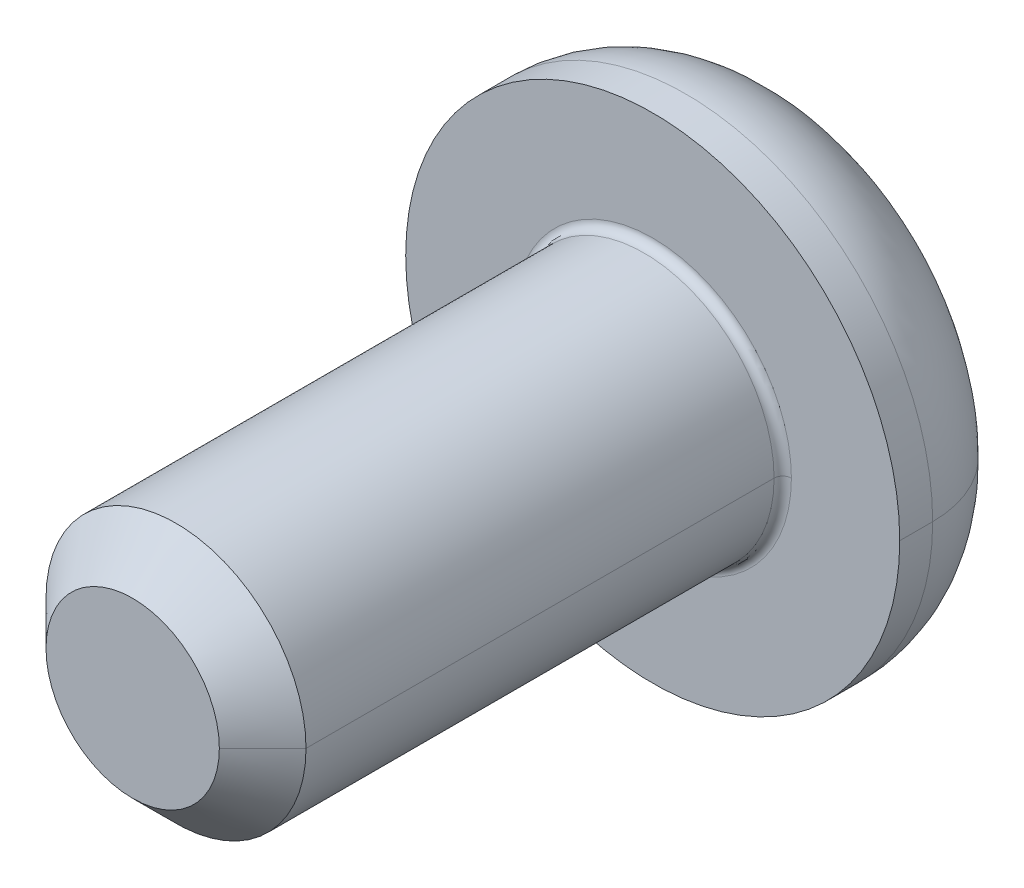
ISO-10303-21;
HEADER;
FILE_DESCRIPTION(('STEP AP214'),'2;1');
FILE_NAME('part.step','',(''),(''),'','','');
FILE_SCHEMA(('AUTOMOTIVE_DESIGN { 1 0 10303 214 1 1 1 1 }'));
ENDSEC;
DATA;
#1=APPLICATION_CONTEXT('core data for automotive mechanical design processes');
#2=APPLICATION_PROTOCOL_DEFINITION('international standard','automotive_design',2000,#1);
#3=PRODUCT_CONTEXT('',#1,'mechanical');
#4=PRODUCT('Part','Part','',(#3));
#5=PRODUCT_RELATED_PRODUCT_CATEGORY('part','',(#4));
#6=PRODUCT_DEFINITION_FORMATION('','',#4);
#7=PRODUCT_DEFINITION_CONTEXT('part definition',#1,'design');
#8=PRODUCT_DEFINITION('design','',#6,#7);
#9=PRODUCT_DEFINITION_SHAPE('','',#8);
#10=(LENGTH_UNIT() NAMED_UNIT(*) SI_UNIT(.MILLI.,.METRE.));
#11=(NAMED_UNIT(*) PLANE_ANGLE_UNIT() SI_UNIT($,.RADIAN.));
#12=(NAMED_UNIT(*) SI_UNIT($,.STERADIAN.) SOLID_ANGLE_UNIT());
#13=UNCERTAINTY_MEASURE_WITH_UNIT(LENGTH_MEASURE(1.E-05),#10,'distance_accuracy_value','');
#14=(GEOMETRIC_REPRESENTATION_CONTEXT(3) GLOBAL_UNCERTAINTY_ASSIGNED_CONTEXT((#13)) GLOBAL_UNIT_ASSIGNED_CONTEXT((#10,
#11,#12)) REPRESENTATION_CONTEXT('',''));
#15=CARTESIAN_POINT('',(0.,0.,0.));
#16=DIRECTION('',(0.,0.,1.));
#17=DIRECTION('',(1.,0.,0.));
#18=AXIS2_PLACEMENT_3D('',#15,#16,#17);
#19=CARTESIAN_POINT('',(0.,0.,0.1));
#20=DIRECTION('',(0.,0.,-1.));
#21=DIRECTION('',(-1.,0.,0.));
#22=AXIS2_PLACEMENT_3D('',#19,#20,#21);
#23=TOROIDAL_SURFACE('',#22,1.6,0.1);
#24=CARTESIAN_POINT('',(1.6,0.,0.1));
#25=DIRECTION('',(0.,1.,0.));
#26=DIRECTION('',(-1.,0.,0.));
#27=AXIS2_PLACEMENT_3D('',#24,#25,#26);
#28=CIRCLE('',#27,0.1);
#29=CARTESIAN_POINT('',(1.6,0.,0.));
#30=VERTEX_POINT('',#29);
#31=CARTESIAN_POINT('',(1.5,0.,0.1));
#32=VERTEX_POINT('',#31);
#33=EDGE_CURVE('E271',#30,#32,#28,.T.);
#34=ORIENTED_EDGE('',*,*,#33,.F.);
#35=CARTESIAN_POINT('',(0.,0.,0.));
#36=DIRECTION('',(0.,0.,-1.));
#37=DIRECTION('',(-1.,0.,0.));
#38=AXIS2_PLACEMENT_3D('',#35,#36,#37);
#39=CIRCLE('',#38,1.6);
#40=CARTESIAN_POINT('',(-1.6,0.,0.));
#41=VERTEX_POINT('',#40);
#42=EDGE_CURVE('E157',#41,#30,#39,.T.);
#43=ORIENTED_EDGE('',*,*,#42,.F.);
#44=CARTESIAN_POINT('',(-1.6,0.,0.1));
#45=DIRECTION('',(0.,-1.,0.));
#46=DIRECTION('',(0.,0.,-1.));
#47=AXIS2_PLACEMENT_3D('',#44,#45,#46);
#48=CIRCLE('',#47,0.1);
#49=CARTESIAN_POINT('',(-1.5,0.,0.1));
#50=VERTEX_POINT('',#49);
#51=EDGE_CURVE('E270',#41,#50,#48,.T.);
#52=ORIENTED_EDGE('',*,*,#51,.T.);
#53=CARTESIAN_POINT('',(0.,0.,0.1));
#54=DIRECTION('',(0.,0.,1.));
#55=DIRECTION('',(-1.,0.,0.));
#56=AXIS2_PLACEMENT_3D('',#53,#54,#55);
#57=CIRCLE('',#56,1.5);
#58=EDGE_CURVE('E212',#32,#50,#57,.T.);
#59=ORIENTED_EDGE('',*,*,#58,.F.);
#60=EDGE_LOOP('',(#34,#43,#52,#59));
#61=FACE_BOUND('',#60,.T.);
#62=ADVANCED_FACE('F17',(#61),#23,.F.);
#63=CARTESIAN_POINT('',(0.,0.,-0.38));
#64=DIRECTION('',(0.,0.,-1.));
#65=DIRECTION('',(-1.,0.,0.));
#66=AXIS2_PLACEMENT_3D('',#63,#64,#65);
#67=TOROIDAL_SURFACE('',#66,1.58,1.27);
#68=CARTESIAN_POINT('',(1.58,0.,-0.38));
#69=DIRECTION('',(0.,1.,0.));
#70=DIRECTION('',(-1.,0.,0.));
#71=AXIS2_PLACEMENT_3D('',#68,#69,#70);
#72=CIRCLE('',#71,1.27);
#73=CARTESIAN_POINT('',(2.85,0.,-0.38));
#74=VERTEX_POINT('',#73);
#75=CARTESIAN_POINT('',(1.58,0.,-1.65));
#76=VERTEX_POINT('',#75);
#77=EDGE_CURVE('E261',#74,#76,#72,.T.);
#78=ORIENTED_EDGE('',*,*,#77,.F.);
#79=CARTESIAN_POINT('',(0.,0.,-0.38));
#80=DIRECTION('',(0.,0.,1.));
#81=DIRECTION('',(-1.,0.,0.));
#82=AXIS2_PLACEMENT_3D('',#79,#80,#81);
#83=CIRCLE('',#82,2.85);
#84=CARTESIAN_POINT('',(-2.85,0.,-0.38));
#85=VERTEX_POINT('',#84);
#86=EDGE_CURVE('E195',#85,#74,#83,.T.);
#87=ORIENTED_EDGE('',*,*,#86,.F.);
#88=CARTESIAN_POINT('',(-1.58,0.,-0.38));
#89=DIRECTION('',(0.,-1.,0.));
#90=DIRECTION('',(0.,0.,-1.));
#91=AXIS2_PLACEMENT_3D('',#88,#89,#90);
#92=CIRCLE('',#91,1.27);
#93=CARTESIAN_POINT('',(-1.58,0.,-1.65));
#94=VERTEX_POINT('',#93);
#95=EDGE_CURVE('E242',#85,#94,#92,.T.);
#96=ORIENTED_EDGE('',*,*,#95,.T.);
#97=CARTESIAN_POINT('',(0.,0.,-1.65));
#98=DIRECTION('',(0.,0.,-1.));
#99=DIRECTION('',(-1.,0.,0.));
#100=AXIS2_PLACEMENT_3D('',#97,#98,#99);
#101=CIRCLE('',#100,1.58);
#102=EDGE_CURVE('E183',#76,#94,#101,.T.);
#103=ORIENTED_EDGE('',*,*,#102,.F.);
#104=EDGE_LOOP('',(#78,#87,#96,#103));
#105=FACE_BOUND('',#104,.T.);
#106=ADVANCED_FACE('F383',(#105),#67,.T.);
#107=CARTESIAN_POINT('',(0.,0.,-0.61));
#108=DIRECTION('',(0.,0.,-1.));
#109=DIRECTION('',(0.,-1.,0.));
#110=AXIS2_PLACEMENT_3D('',#107,#108,#109);
#111=PLANE('',#110);
#112=DIRECTION('',(-1.,0.,0.));
#113=VECTOR('',#112,1.);
#114=CARTESIAN_POINT('',(0.577350269189626,-1.,-0.61));
#115=LINE('',#114,#113);
#116=CARTESIAN_POINT('',(0.577350269189626,-1.,-0.61));
#117=VERTEX_POINT('',#116);
#118=CARTESIAN_POINT('',(-0.577350269189626,-1.,-0.61));
#119=VERTEX_POINT('',#118);
#120=EDGE_CURVE('E129',#117,#119,#115,.T.);
#121=ORIENTED_EDGE('',*,*,#120,.T.);
#122=DIRECTION('',(-0.5,0.866025403784439,0.));
#123=VECTOR('',#122,1.);
#124=CARTESIAN_POINT('',(-0.577350269189626,-1.,-0.61));
#125=LINE('',#124,#123);
#126=CARTESIAN_POINT('',(-1.15470053837925,0.,-0.61));
#127=VERTEX_POINT('',#126);
#128=EDGE_CURVE('E11',#119,#127,#125,.T.);
#129=ORIENTED_EDGE('',*,*,#128,.T.);
#130=DIRECTION('',(0.5,0.866025403784439,0.));
#131=VECTOR('',#130,1.);
#132=CARTESIAN_POINT('',(-1.15470053837925,0.,-0.61));
#133=LINE('',#132,#131);
#134=CARTESIAN_POINT('',(-0.577350269189626,1.,-0.61));
#135=VERTEX_POINT('',#134);
#136=EDGE_CURVE('E47',#127,#135,#133,.T.);
#137=ORIENTED_EDGE('',*,*,#136,.T.);
#138=DIRECTION('',(1.,0.,0.));
#139=VECTOR('',#138,1.);
#140=CARTESIAN_POINT('',(-0.577350269189626,1.,-0.61));
#141=LINE('',#140,#139);
#142=CARTESIAN_POINT('',(0.577350269189626,1.,-0.61));
#143=VERTEX_POINT('',#142);
#144=EDGE_CURVE('E104',#135,#143,#141,.T.);
#145=ORIENTED_EDGE('',*,*,#144,.T.);
#146=DIRECTION('',(0.5,-0.866025403784439,0.));
#147=VECTOR('',#146,1.);
#148=CARTESIAN_POINT('',(0.577350269189626,1.,-0.61));
#149=LINE('',#148,#147);
#150=CARTESIAN_POINT('',(1.15470053837925,0.,-0.61));
#151=VERTEX_POINT('',#150);
#152=EDGE_CURVE('E97',#143,#151,#149,.T.);
#153=ORIENTED_EDGE('',*,*,#152,.T.);
#154=DIRECTION('',(-0.5,-0.866025403784439,0.));
#155=VECTOR('',#154,1.);
#156=CARTESIAN_POINT('',(1.15470053837925,0.,-0.61));
#157=LINE('',#156,#155);
#158=EDGE_CURVE('E101',#151,#117,#157,.T.);
#159=ORIENTED_EDGE('',*,*,#158,.T.);
#160=EDGE_LOOP('',(#121,#129,#137,#145,#153,#159));
#161=FACE_BOUND('',#160,.T.);
#162=ADVANCED_FACE('F99',(#161),#111,.T.);
#163=CARTESIAN_POINT('',(-0.577350269189626,-1.,-0.61));
#164=DIRECTION('',(-0.866025403784439,-0.5,0.));
#165=DIRECTION('',(-0.5,0.866025403784439,0.));
#166=AXIS2_PLACEMENT_3D('',#163,#164,#165);
#167=PLANE('',#166);
#168=DIRECTION('',(-0.5,0.866025403784439,0.));
#169=VECTOR('',#168,1.);
#170=CARTESIAN_POINT('',(-0.577350269189626,-1.,-1.65));
#171=LINE('',#170,#169);
#172=CARTESIAN_POINT('',(-0.577350269189626,-1.,-1.65));
#173=VERTEX_POINT('',#172);
#174=CARTESIAN_POINT('',(-1.15470053837925,0.,-1.65));
#175=VERTEX_POINT('',#174);
#176=EDGE_CURVE('E149',#173,#175,#171,.T.);
#177=ORIENTED_EDGE('',*,*,#176,.T.);
#178=DIRECTION('',(0.,0.,-1.));
#179=VECTOR('',#178,1.);
#180=CARTESIAN_POINT('',(-1.15470053837925,0.,-0.61));
#181=LINE('',#180,#179);
#182=EDGE_CURVE('E25',#127,#175,#181,.T.);
#183=ORIENTED_EDGE('',*,*,#182,.F.);
#184=ORIENTED_EDGE('',*,*,#128,.F.);
#185=DIRECTION('',(0.,0.,-1.));
#186=VECTOR('',#185,1.);
#187=CARTESIAN_POINT('',(-0.577350269189626,-1.,-0.61));
#188=LINE('',#187,#186);
#189=EDGE_CURVE('E152',#119,#173,#188,.T.);
#190=ORIENTED_EDGE('',*,*,#189,.T.);
#191=EDGE_LOOP('',(#177,#183,#184,#190));
#192=FACE_BOUND('',#191,.T.);
#193=ADVANCED_FACE('F150',(#192),#167,.F.);
#194=CARTESIAN_POINT('',(-1.15470053837925,0.,-0.61));
#195=DIRECTION('',(-0.866025403784439,0.5,0.));
#196=DIRECTION('',(0.,0.,1.));
#197=AXIS2_PLACEMENT_3D('',#194,#195,#196);
#198=PLANE('',#197);
#199=DIRECTION('',(0.5,0.866025403784439,0.));
#200=VECTOR('',#199,1.);
#201=CARTESIAN_POINT('',(-1.15470053837925,0.,-1.65));
#202=LINE('',#201,#200);
#203=CARTESIAN_POINT('',(-0.577350269189626,1.,-1.65));
#204=VERTEX_POINT('',#203);
#205=EDGE_CURVE('E145',#175,#204,#202,.T.);
#206=ORIENTED_EDGE('',*,*,#205,.T.);
#207=DIRECTION('',(0.,0.,-1.));
#208=VECTOR('',#207,1.);
#209=CARTESIAN_POINT('',(-0.577350269189626,1.,-0.61));
#210=LINE('',#209,#208);
#211=EDGE_CURVE('E136',#135,#204,#210,.T.);
#212=ORIENTED_EDGE('',*,*,#211,.F.);
#213=ORIENTED_EDGE('',*,*,#136,.F.);
#214=ORIENTED_EDGE('',*,*,#182,.T.);
#215=EDGE_LOOP('',(#206,#212,#213,#214));
#216=FACE_BOUND('',#215,.T.);
#217=ADVANCED_FACE('F143',(#216),#198,.F.);
#218=CARTESIAN_POINT('',(-0.577350269189626,1.,-0.61));
#219=DIRECTION('',(0.,1.,0.));
#220=DIRECTION('',(1.,0.,0.));
#221=AXIS2_PLACEMENT_3D('',#218,#219,#220);
#222=PLANE('',#221);
#223=DIRECTION('',(1.,0.,0.));
#224=VECTOR('',#223,1.);
#225=CARTESIAN_POINT('',(-0.577350269189626,1.,-1.65));
#226=LINE('',#225,#224);
#227=CARTESIAN_POINT('',(0.577350269189626,1.,-1.65));
#228=VERTEX_POINT('',#227);
#229=EDGE_CURVE('E162',#204,#228,#226,.T.);
#230=ORIENTED_EDGE('',*,*,#229,.T.);
#231=DIRECTION('',(0.,0.,-1.));
#232=VECTOR('',#231,1.);
#233=CARTESIAN_POINT('',(0.577350269189626,1.,-0.61));
#234=LINE('',#233,#232);
#235=EDGE_CURVE('E108',#143,#228,#234,.T.);
#236=ORIENTED_EDGE('',*,*,#235,.F.);
#237=ORIENTED_EDGE('',*,*,#144,.F.);
#238=ORIENTED_EDGE('',*,*,#211,.T.);
#239=EDGE_LOOP('',(#230,#236,#237,#238));
#240=FACE_BOUND('',#239,.T.);
#241=ADVANCED_FACE('F396',(#240),#222,.F.);
#242=CARTESIAN_POINT('',(0.577350269189626,1.,-0.61));
#243=DIRECTION('',(0.866025403784439,0.5,0.));
#244=DIRECTION('',(0.,0.,-1.));
#245=AXIS2_PLACEMENT_3D('',#242,#243,#244);
#246=PLANE('',#245);
#247=DIRECTION('',(0.5,-0.866025403784439,0.));
#248=VECTOR('',#247,1.);
#249=CARTESIAN_POINT('',(0.577350269189626,1.,-1.65));
#250=LINE('',#249,#248);
#251=CARTESIAN_POINT('',(1.15470053837925,0.,-1.65));
#252=VERTEX_POINT('',#251);
#253=EDGE_CURVE('E114',#228,#252,#250,.T.);
#254=ORIENTED_EDGE('',*,*,#253,.T.);
#255=DIRECTION('',(0.,0.,-1.));
#256=VECTOR('',#255,1.);
#257=CARTESIAN_POINT('',(1.15470053837925,0.,-0.61));
#258=LINE('',#257,#256);
#259=EDGE_CURVE('E109',#151,#252,#258,.T.);
#260=ORIENTED_EDGE('',*,*,#259,.F.);
#261=ORIENTED_EDGE('',*,*,#152,.F.);
#262=ORIENTED_EDGE('',*,*,#235,.T.);
#263=EDGE_LOOP('',(#254,#260,#261,#262));
#264=FACE_BOUND('',#263,.T.);
#265=ADVANCED_FACE('F112',(#264),#246,.F.);
#266=CARTESIAN_POINT('',(1.15470053837925,0.,-0.61));
#267=DIRECTION('',(0.866025403784439,-0.5,0.));
#268=DIRECTION('',(0.,0.,-1.));
#269=AXIS2_PLACEMENT_3D('',#266,#267,#268);
#270=PLANE('',#269);
#271=DIRECTION('',(-0.5,-0.866025403784439,0.));
#272=VECTOR('',#271,1.);
#273=CARTESIAN_POINT('',(1.15470053837925,0.,-1.65));
#274=LINE('',#273,#272);
#275=CARTESIAN_POINT('',(0.577350269189626,-1.,-1.65));
#276=VERTEX_POINT('',#275);
#277=EDGE_CURVE('E182',#252,#276,#274,.T.);
#278=ORIENTED_EDGE('',*,*,#277,.T.);
#279=DIRECTION('',(0.,0.,-1.));
#280=VECTOR('',#279,1.);
#281=CARTESIAN_POINT('',(0.577350269189626,-1.,-0.61));
#282=LINE('',#281,#280);
#283=EDGE_CURVE('E121',#117,#276,#282,.T.);
#284=ORIENTED_EDGE('',*,*,#283,.F.);
#285=ORIENTED_EDGE('',*,*,#158,.F.);
#286=ORIENTED_EDGE('',*,*,#259,.T.);
#287=EDGE_LOOP('',(#278,#284,#285,#286));
#288=FACE_BOUND('',#287,.T.);
#289=ADVANCED_FACE('F120',(#288),#270,.F.);
#290=CARTESIAN_POINT('',(0.577350269189626,-1.,-0.61));
#291=DIRECTION('',(0.,-1.,0.));
#292=DIRECTION('',(-1.,0.,0.));
#293=AXIS2_PLACEMENT_3D('',#290,#291,#292);
#294=PLANE('',#293);
#295=DIRECTION('',(-1.,0.,0.));
#296=VECTOR('',#295,1.);
#297=CARTESIAN_POINT('',(0.577350269189626,-1.,-1.65));
#298=LINE('',#297,#296);
#299=EDGE_CURVE('E180',#276,#173,#298,.T.);
#300=ORIENTED_EDGE('',*,*,#299,.T.);
#301=ORIENTED_EDGE('',*,*,#189,.F.);
#302=ORIENTED_EDGE('',*,*,#120,.F.);
#303=ORIENTED_EDGE('',*,*,#283,.T.);
#304=EDGE_LOOP('',(#300,#301,#302,#303));
#305=FACE_BOUND('',#304,.T.);
#306=ADVANCED_FACE('F179',(#305),#294,.F.);
#307=CARTESIAN_POINT('',(0.,0.,0.));
#308=DIRECTION('',(0.,0.,-1.));
#309=DIRECTION('',(0.,-1.,0.));
#310=AXIS2_PLACEMENT_3D('',#307,#308,#309);
#311=PLANE('',#310);
#312=ORIENTED_EDGE('',*,*,#42,.T.);
#313=CARTESIAN_POINT('',(0.,0.,0.));
#314=DIRECTION('',(0.,0.,-1.));
#315=DIRECTION('',(-1.,0.,0.));
#316=AXIS2_PLACEMENT_3D('',#313,#314,#315);
#317=CIRCLE('',#316,1.6);
#318=EDGE_CURVE('E275',#30,#41,#317,.T.);
#319=ORIENTED_EDGE('',*,*,#318,.T.);
#320=EDGE_LOOP('',(#312,#319));
#321=FACE_BOUND('',#320,.T.);
#322=CARTESIAN_POINT('',(0.,0.,0.));
#323=DIRECTION('',(0.,0.,-1.));
#324=DIRECTION('',(-1.,0.,0.));
#325=AXIS2_PLACEMENT_3D('',#322,#323,#324);
#326=CIRCLE('',#325,2.85);
#327=CARTESIAN_POINT('',(2.85,0.,0.));
#328=VERTEX_POINT('',#327);
#329=CARTESIAN_POINT('',(-2.85,0.,0.));
#330=VERTEX_POINT('',#329);
#331=EDGE_CURVE('E190',#328,#330,#326,.T.);
#332=ORIENTED_EDGE('',*,*,#331,.F.);
#333=CARTESIAN_POINT('',(0.,0.,0.));
#334=DIRECTION('',(0.,0.,-1.));
#335=DIRECTION('',(-1.,0.,0.));
#336=AXIS2_PLACEMENT_3D('',#333,#334,#335);
#337=CIRCLE('',#336,2.85);
#338=EDGE_CURVE('E231',#330,#328,#337,.T.);
#339=ORIENTED_EDGE('',*,*,#338,.F.);
#340=EDGE_LOOP('',(#332,#339));
#341=FACE_BOUND('',#340,.T.);
#342=ADVANCED_FACE('F346',(#321,#341),#311,.F.);
#343=CARTESIAN_POINT('',(0.,0.,-1.65));
#344=DIRECTION('',(0.,0.,-1.));
#345=DIRECTION('',(0.,-1.,0.));
#346=AXIS2_PLACEMENT_3D('',#343,#344,#345);
#347=PLANE('',#346);
#348=ORIENTED_EDGE('',*,*,#299,.F.);
#349=ORIENTED_EDGE('',*,*,#277,.F.);
#350=ORIENTED_EDGE('',*,*,#253,.F.);
#351=ORIENTED_EDGE('',*,*,#229,.F.);
#352=ORIENTED_EDGE('',*,*,#205,.F.);
#353=ORIENTED_EDGE('',*,*,#176,.F.);
#354=EDGE_LOOP('',(#348,#349,#350,#351,#352,#353));
#355=FACE_BOUND('',#354,.T.);
#356=CARTESIAN_POINT('',(0.,0.,-1.65));
#357=DIRECTION('',(0.,0.,-1.));
#358=DIRECTION('',(-1.,0.,0.));
#359=AXIS2_PLACEMENT_3D('',#356,#357,#358);
#360=CIRCLE('',#359,1.58);
#361=EDGE_CURVE('E252',#94,#76,#360,.T.);
#362=ORIENTED_EDGE('',*,*,#361,.T.);
#363=ORIENTED_EDGE('',*,*,#102,.T.);
#364=EDGE_LOOP('',(#362,#363));
#365=FACE_BOUND('',#364,.T.);
#366=ADVANCED_FACE('F159',(#355,#365),#347,.T.);
#367=CARTESIAN_POINT('',(0.,0.,-1.65));
#368=DIRECTION('',(0.,0.,1.));
#369=DIRECTION('',(1.,0.,0.));
#370=AXIS2_PLACEMENT_3D('',#367,#368,#369);
#371=CYLINDRICAL_SURFACE('',#370,2.85);
#372=DIRECTION('',(0.,0.,1.));
#373=VECTOR('',#372,1.);
#374=CARTESIAN_POINT('',(-2.85,0.,-1.65));
#375=LINE('',#374,#373);
#376=EDGE_CURVE('E235',#85,#330,#375,.T.);
#377=ORIENTED_EDGE('',*,*,#376,.F.);
#378=ORIENTED_EDGE('',*,*,#86,.T.);
#379=DIRECTION('',(0.,0.,1.));
#380=VECTOR('',#379,1.);
#381=CARTESIAN_POINT('',(2.85,0.,-1.65));
#382=LINE('',#381,#380);
#383=EDGE_CURVE('E222',#74,#328,#382,.T.);
#384=ORIENTED_EDGE('',*,*,#383,.T.);
#385=ORIENTED_EDGE('',*,*,#331,.T.);
#386=EDGE_LOOP('',(#377,#378,#384,#385));
#387=FACE_BOUND('',#386,.T.);
#388=ADVANCED_FACE('F379',(#387),#371,.T.);
#389=CARTESIAN_POINT('',(0.,0.,6.));
#390=DIRECTION('',(0.,0.,-1.));
#391=DIRECTION('',(-1.,0.,0.));
#392=AXIS2_PLACEMENT_3D('',#389,#390,#391);
#393=CONICAL_SURFACE('',#392,1.,0.785398163397446);
#394=DIRECTION('',(0.707106781186546,0.,-0.707106781186549));
#395=VECTOR('',#394,1.);
#396=CARTESIAN_POINT('',(1.,0.,6.));
#397=LINE('',#396,#395);
#398=CARTESIAN_POINT('',(1.,0.,6.));
#399=VERTEX_POINT('',#398);
#400=CARTESIAN_POINT('',(1.5,0.,5.5));
#401=VERTEX_POINT('',#400);
#402=EDGE_CURVE('E221',#399,#401,#397,.T.);
#403=ORIENTED_EDGE('',*,*,#402,.F.);
#404=CARTESIAN_POINT('',(0.,0.,6.));
#405=DIRECTION('',(0.,0.,1.));
#406=DIRECTION('',(1.,0.,0.));
#407=AXIS2_PLACEMENT_3D('',#404,#405,#406);
#408=CIRCLE('',#407,1.);
#409=CARTESIAN_POINT('',(-1.,0.,6.));
#410=VERTEX_POINT('',#409);
#411=EDGE_CURVE('E199',#410,#399,#408,.T.);
#412=ORIENTED_EDGE('',*,*,#411,.F.);
#413=DIRECTION('',(-0.707106781186546,0.,-0.707106781186549));
#414=VECTOR('',#413,1.);
#415=CARTESIAN_POINT('',(-1.,0.,6.));
#416=LINE('',#415,#414);
#417=CARTESIAN_POINT('',(-1.5,0.,5.5));
#418=VERTEX_POINT('',#417);
#419=EDGE_CURVE('E230',#410,#418,#416,.T.);
#420=ORIENTED_EDGE('',*,*,#419,.T.);
#421=CARTESIAN_POINT('',(0.,0.,5.5));
#422=DIRECTION('',(0.,0.,-1.));
#423=DIRECTION('',(1.,0.,0.));
#424=AXIS2_PLACEMENT_3D('',#421,#422,#423);
#425=CIRCLE('',#424,1.5);
#426=EDGE_CURVE('E203',#401,#418,#425,.T.);
#427=ORIENTED_EDGE('',*,*,#426,.F.);
#428=EDGE_LOOP('',(#403,#412,#420,#427));
#429=FACE_BOUND('',#428,.T.);
#430=ADVANCED_FACE('F368',(#429),#393,.T.);
#431=CARTESIAN_POINT('',(0.,0.,6.));
#432=DIRECTION('',(0.,0.,1.));
#433=DIRECTION('',(1.,0.,0.));
#434=AXIS2_PLACEMENT_3D('',#431,#432,#433);
#435=PLANE('',#434);
#436=ORIENTED_EDGE('',*,*,#411,.T.);
#437=CARTESIAN_POINT('',(0.,0.,6.));
#438=DIRECTION('',(0.,0.,1.));
#439=DIRECTION('',(1.,0.,0.));
#440=AXIS2_PLACEMENT_3D('',#437,#438,#439);
#441=CIRCLE('',#440,1.);
#442=EDGE_CURVE('E217',#399,#410,#441,.T.);
#443=ORIENTED_EDGE('',*,*,#442,.T.);
#444=EDGE_LOOP('',(#436,#443));
#445=FACE_BOUND('',#444,.T.);
#446=ADVANCED_FACE('F370',(#445),#435,.T.);
#447=CARTESIAN_POINT('',(0.,0.,6.));
#448=DIRECTION('',(0.,0.,-1.));
#449=DIRECTION('',(-1.,0.,0.));
#450=AXIS2_PLACEMENT_3D('',#447,#448,#449);
#451=CYLINDRICAL_SURFACE('',#450,1.5);
#452=DIRECTION('',(0.,0.,-1.));
#453=VECTOR('',#452,1.);
#454=CARTESIAN_POINT('',(1.5,0.,6.));
#455=LINE('',#454,#453);
#456=EDGE_CURVE('E216',#401,#32,#455,.T.);
#457=ORIENTED_EDGE('',*,*,#456,.F.);
#458=ORIENTED_EDGE('',*,*,#426,.T.);
#459=DIRECTION('',(0.,0.,-1.));
#460=VECTOR('',#459,1.);
#461=CARTESIAN_POINT('',(-1.5,0.,6.));
#462=LINE('',#461,#460);
#463=EDGE_CURVE('E208',#418,#50,#462,.T.);
#464=ORIENTED_EDGE('',*,*,#463,.T.);
#465=CARTESIAN_POINT('',(0.,0.,0.1));
#466=DIRECTION('',(0.,0.,1.));
#467=DIRECTION('',(-1.,0.,0.));
#468=AXIS2_PLACEMENT_3D('',#465,#466,#467);
#469=CIRCLE('',#468,1.5);
#470=EDGE_CURVE('E266',#50,#32,#469,.T.);
#471=ORIENTED_EDGE('',*,*,#470,.T.);
#472=EDGE_LOOP('',(#457,#458,#464,#471));
#473=FACE_BOUND('',#472,.T.);
#474=ADVANCED_FACE('F356',(#473),#451,.T.);
#475=CARTESIAN_POINT('',(0.,0.,6.));
#476=DIRECTION('',(0.,0.,-1.));
#477=DIRECTION('',(-1.,0.,0.));
#478=AXIS2_PLACEMENT_3D('',#475,#476,#477);
#479=CYLINDRICAL_SURFACE('',#478,1.5);
#480=CARTESIAN_POINT('',(0.,0.,5.5));
#481=DIRECTION('',(0.,0.,-1.));
#482=DIRECTION('',(1.,0.,0.));
#483=AXIS2_PLACEMENT_3D('',#480,#481,#482);
#484=CIRCLE('',#483,1.5);
#485=EDGE_CURVE('E226',#418,#401,#484,.T.);
#486=ORIENTED_EDGE('',*,*,#485,.T.);
#487=ORIENTED_EDGE('',*,*,#456,.T.);
#488=ORIENTED_EDGE('',*,*,#58,.T.);
#489=ORIENTED_EDGE('',*,*,#463,.F.);
#490=EDGE_LOOP('',(#486,#487,#488,#489));
#491=FACE_BOUND('',#490,.T.);
#492=ADVANCED_FACE('F359',(#491),#479,.T.);
#493=CARTESIAN_POINT('',(0.,0.,6.));
#494=DIRECTION('',(0.,0.,-1.));
#495=DIRECTION('',(-1.,0.,0.));
#496=AXIS2_PLACEMENT_3D('',#493,#494,#495);
#497=CONICAL_SURFACE('',#496,1.,0.785398163397446);
#498=ORIENTED_EDGE('',*,*,#442,.F.);
#499=ORIENTED_EDGE('',*,*,#402,.T.);
#500=ORIENTED_EDGE('',*,*,#485,.F.);
#501=ORIENTED_EDGE('',*,*,#419,.F.);
#502=EDGE_LOOP('',(#498,#499,#500,#501));
#503=FACE_BOUND('',#502,.T.);
#504=ADVANCED_FACE('F365',(#503),#497,.T.);
#505=CARTESIAN_POINT('',(0.,0.,-1.65));
#506=DIRECTION('',(0.,0.,1.));
#507=DIRECTION('',(1.,0.,0.));
#508=AXIS2_PLACEMENT_3D('',#505,#506,#507);
#509=CYLINDRICAL_SURFACE('',#508,2.85);
#510=CARTESIAN_POINT('',(0.,0.,-0.38));
#511=DIRECTION('',(0.,0.,1.));
#512=DIRECTION('',(-1.,0.,0.));
#513=AXIS2_PLACEMENT_3D('',#510,#511,#512);
#514=CIRCLE('',#513,2.85);
#515=EDGE_CURVE('E265',#74,#85,#514,.T.);
#516=ORIENTED_EDGE('',*,*,#515,.T.);
#517=ORIENTED_EDGE('',*,*,#376,.T.);
#518=ORIENTED_EDGE('',*,*,#338,.T.);
#519=ORIENTED_EDGE('',*,*,#383,.F.);
#520=EDGE_LOOP('',(#516,#517,#518,#519));
#521=FACE_BOUND('',#520,.T.);
#522=ADVANCED_FACE('F290',(#521),#509,.T.);
#523=CARTESIAN_POINT('',(0.,0.,-0.38));
#524=DIRECTION('',(0.,0.,-1.));
#525=DIRECTION('',(-1.,0.,0.));
#526=AXIS2_PLACEMENT_3D('',#523,#524,#525);
#527=TOROIDAL_SURFACE('',#526,1.58,1.27);
#528=ORIENTED_EDGE('',*,*,#515,.F.);
#529=ORIENTED_EDGE('',*,*,#77,.T.);
#530=ORIENTED_EDGE('',*,*,#361,.F.);
#531=ORIENTED_EDGE('',*,*,#95,.F.);
#532=EDGE_LOOP('',(#528,#529,#530,#531));
#533=FACE_BOUND('',#532,.T.);
#534=ADVANCED_FACE('F301',(#533),#527,.T.);
#535=CARTESIAN_POINT('',(0.,0.,0.1));
#536=DIRECTION('',(0.,0.,-1.));
#537=DIRECTION('',(-1.,0.,0.));
#538=AXIS2_PLACEMENT_3D('',#535,#536,#537);
#539=TOROIDAL_SURFACE('',#538,1.6,0.1);
#540=ORIENTED_EDGE('',*,*,#318,.F.);
#541=ORIENTED_EDGE('',*,*,#33,.T.);
#542=ORIENTED_EDGE('',*,*,#470,.F.);
#543=ORIENTED_EDGE('',*,*,#51,.F.);
#544=EDGE_LOOP('',(#540,#541,#542,#543));
#545=FACE_BOUND('',#544,.T.);
#546=ADVANCED_FACE('F353',(#545),#539,.F.);
#547=CLOSED_SHELL('',(#62,#106,#162,#193,#217,#241,#265,#289,#306,#342,#366,#388,#430,#446,#474,
#492,#504,#522,#534,#546));
#548=MANIFOLD_SOLID_BREP('B1',#547);
#549=ADVANCED_BREP_SHAPE_REPRESENTATION('',(#18,#548),#14);
#550=SHAPE_DEFINITION_REPRESENTATION(#9,#549);
ENDSEC;
END-ISO-10303-21;
